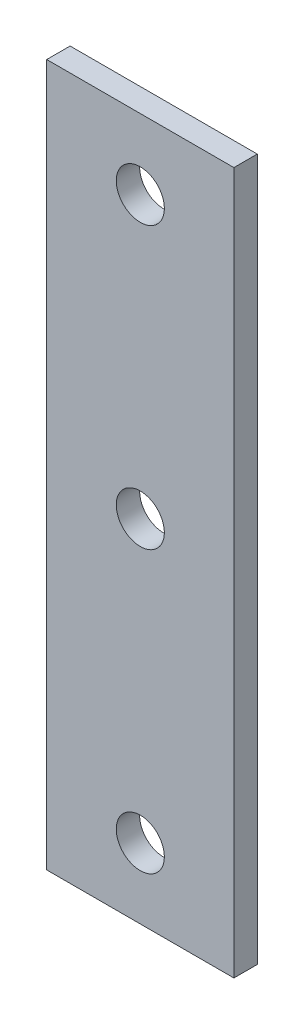
ISO-10303-21;
HEADER;
FILE_DESCRIPTION(('STEP AP214'),'2;1');
FILE_NAME('part.step','',(''),(''),'','','');
FILE_SCHEMA(('AUTOMOTIVE_DESIGN { 1 0 10303 214 1 1 1 1 }'));
ENDSEC;
DATA;
#1=APPLICATION_CONTEXT('core data for automotive mechanical design processes');
#2=APPLICATION_PROTOCOL_DEFINITION('international standard','automotive_design',2000,#1);
#3=PRODUCT_CONTEXT('',#1,'mechanical');
#4=PRODUCT('Part','Part','',(#3));
#5=PRODUCT_RELATED_PRODUCT_CATEGORY('part','',(#4));
#6=PRODUCT_DEFINITION_FORMATION('','',#4);
#7=PRODUCT_DEFINITION_CONTEXT('part definition',#1,'design');
#8=PRODUCT_DEFINITION('design','',#6,#7);
#9=PRODUCT_DEFINITION_SHAPE('','',#8);
#10=(LENGTH_UNIT() NAMED_UNIT(*) SI_UNIT(.MILLI.,.METRE.));
#11=(NAMED_UNIT(*) PLANE_ANGLE_UNIT() SI_UNIT($,.RADIAN.));
#12=(NAMED_UNIT(*) SI_UNIT($,.STERADIAN.) SOLID_ANGLE_UNIT());
#13=UNCERTAINTY_MEASURE_WITH_UNIT(LENGTH_MEASURE(1.E-05),#10,'distance_accuracy_value','');
#14=(GEOMETRIC_REPRESENTATION_CONTEXT(3) GLOBAL_UNCERTAINTY_ASSIGNED_CONTEXT((#13)) GLOBAL_UNIT_ASSIGNED_CONTEXT((#10,
#11,#12)) REPRESENTATION_CONTEXT('',''));
#15=CARTESIAN_POINT('',(0.,0.,0.));
#16=DIRECTION('',(0.,0.,1.));
#17=DIRECTION('',(1.,0.,0.));
#18=AXIS2_PLACEMENT_3D('',#15,#16,#17);
#19=CARTESIAN_POINT('',(6.35,-23.8125,-1.5875));
#20=DIRECTION('',(1.,0.,0.));
#21=DIRECTION('',(0.,0.,-1.));
#22=AXIS2_PLACEMENT_3D('',#19,#20,#21);
#23=PLANE('',#22);
#24=DIRECTION('',(0.,1.,0.));
#25=VECTOR('',#24,1.);
#26=CARTESIAN_POINT('',(6.35,-23.8125,0.));
#27=LINE('',#26,#25);
#28=CARTESIAN_POINT('',(6.35,-23.8125,0.));
#29=VERTEX_POINT('',#28);
#30=CARTESIAN_POINT('',(6.35,23.8125,0.));
#31=VERTEX_POINT('',#30);
#32=EDGE_CURVE('E101',#29,#31,#27,.T.);
#33=ORIENTED_EDGE('',*,*,#32,.F.);
#34=DIRECTION('',(0.,0.,1.));
#35=VECTOR('',#34,1.);
#36=CARTESIAN_POINT('',(6.35,-23.8125,-1.5875));
#37=LINE('',#36,#35);
#38=CARTESIAN_POINT('',(6.35,-23.8125,-1.5875));
#39=VERTEX_POINT('',#38);
#40=EDGE_CURVE('E11',#39,#29,#37,.T.);
#41=ORIENTED_EDGE('',*,*,#40,.F.);
#42=DIRECTION('',(0.,1.,0.));
#43=VECTOR('',#42,1.);
#44=CARTESIAN_POINT('',(6.35,-23.8125,-1.5875));
#45=LINE('',#44,#43);
#46=CARTESIAN_POINT('',(6.35,23.8125,-1.5875));
#47=VERTEX_POINT('',#46);
#48=EDGE_CURVE('E94',#39,#47,#45,.T.);
#49=ORIENTED_EDGE('',*,*,#48,.T.);
#50=DIRECTION('',(0.,0.,1.));
#51=VECTOR('',#50,1.);
#52=CARTESIAN_POINT('',(6.35,23.8125,-1.5875));
#53=LINE('',#52,#51);
#54=EDGE_CURVE('E39',#47,#31,#53,.T.);
#55=ORIENTED_EDGE('',*,*,#54,.T.);
#56=EDGE_LOOP('',(#33,#41,#49,#55));
#57=FACE_BOUND('',#56,.T.);
#58=ADVANCED_FACE('F36',(#57),#23,.T.);
#59=CARTESIAN_POINT('',(-6.35,-23.8125,-1.5875));
#60=DIRECTION('',(0.,-1.,0.));
#61=DIRECTION('',(0.,0.,-1.));
#62=AXIS2_PLACEMENT_3D('',#59,#60,#61);
#63=PLANE('',#62);
#64=DIRECTION('',(1.,0.,0.));
#65=VECTOR('',#64,1.);
#66=CARTESIAN_POINT('',(-6.35,-23.8125,0.));
#67=LINE('',#66,#65);
#68=CARTESIAN_POINT('',(-6.35,-23.8125,0.));
#69=VERTEX_POINT('',#68);
#70=EDGE_CURVE('E96',#69,#29,#67,.T.);
#71=ORIENTED_EDGE('',*,*,#70,.F.);
#72=DIRECTION('',(0.,0.,1.));
#73=VECTOR('',#72,1.);
#74=CARTESIAN_POINT('',(-6.35,-23.8125,-1.5875));
#75=LINE('',#74,#73);
#76=CARTESIAN_POINT('',(-6.35,-23.8125,-1.5875));
#77=VERTEX_POINT('',#76);
#78=EDGE_CURVE('E45',#77,#69,#75,.T.);
#79=ORIENTED_EDGE('',*,*,#78,.F.);
#80=DIRECTION('',(1.,0.,0.));
#81=VECTOR('',#80,1.);
#82=CARTESIAN_POINT('',(-6.35,-23.8125,-1.5875));
#83=LINE('',#82,#81);
#84=EDGE_CURVE('E91',#77,#39,#83,.T.);
#85=ORIENTED_EDGE('',*,*,#84,.T.);
#86=ORIENTED_EDGE('',*,*,#40,.T.);
#87=EDGE_LOOP('',(#71,#79,#85,#86));
#88=FACE_BOUND('',#87,.T.);
#89=ADVANCED_FACE('F112',(#88),#63,.T.);
#90=CARTESIAN_POINT('',(-6.35,-23.8125,-1.5875));
#91=DIRECTION('',(-1.,0.,0.));
#92=DIRECTION('',(0.,0.,1.));
#93=AXIS2_PLACEMENT_3D('',#90,#91,#92);
#94=PLANE('',#93);
#95=DIRECTION('',(0.,-1.,0.));
#96=VECTOR('',#95,1.);
#97=CARTESIAN_POINT('',(-6.35,-23.8125,0.));
#98=LINE('',#97,#96);
#99=CARTESIAN_POINT('',(-6.35,23.8125,0.));
#100=VERTEX_POINT('',#99);
#101=EDGE_CURVE('E86',#100,#69,#98,.T.);
#102=ORIENTED_EDGE('',*,*,#101,.F.);
#103=DIRECTION('',(0.,0.,1.));
#104=VECTOR('',#103,1.);
#105=CARTESIAN_POINT('',(-6.35,23.8125,-1.5875));
#106=LINE('',#105,#104);
#107=CARTESIAN_POINT('',(-6.35,23.8125,-1.5875));
#108=VERTEX_POINT('',#107);
#109=EDGE_CURVE('E81',#108,#100,#106,.T.);
#110=ORIENTED_EDGE('',*,*,#109,.F.);
#111=DIRECTION('',(0.,-1.,0.));
#112=VECTOR('',#111,1.);
#113=CARTESIAN_POINT('',(-6.35,-23.8125,-1.5875));
#114=LINE('',#113,#112);
#115=EDGE_CURVE('E84',#108,#77,#114,.T.);
#116=ORIENTED_EDGE('',*,*,#115,.T.);
#117=ORIENTED_EDGE('',*,*,#78,.T.);
#118=EDGE_LOOP('',(#102,#110,#116,#117));
#119=FACE_BOUND('',#118,.T.);
#120=ADVANCED_FACE('F83',(#119),#94,.T.);
#121=CARTESIAN_POINT('',(-6.35,23.8125,-1.5875));
#122=DIRECTION('',(0.,1.,0.));
#123=DIRECTION('',(0.,0.,1.));
#124=AXIS2_PLACEMENT_3D('',#121,#122,#123);
#125=PLANE('',#124);
#126=DIRECTION('',(-1.,0.,0.));
#127=VECTOR('',#126,1.);
#128=CARTESIAN_POINT('',(-6.35,23.8125,0.));
#129=LINE('',#128,#127);
#130=EDGE_CURVE('E104',#31,#100,#129,.T.);
#131=ORIENTED_EDGE('',*,*,#130,.F.);
#132=ORIENTED_EDGE('',*,*,#54,.F.);
#133=DIRECTION('',(-1.,0.,0.));
#134=VECTOR('',#133,1.);
#135=CARTESIAN_POINT('',(-6.35,23.8125,-1.5875));
#136=LINE('',#135,#134);
#137=EDGE_CURVE('E90',#47,#108,#136,.T.);
#138=ORIENTED_EDGE('',*,*,#137,.T.);
#139=ORIENTED_EDGE('',*,*,#109,.T.);
#140=EDGE_LOOP('',(#131,#132,#138,#139));
#141=FACE_BOUND('',#140,.T.);
#142=ADVANCED_FACE('F93',(#141),#125,.T.);
#143=CARTESIAN_POINT('',(0.,0.,-1.5875));
#144=DIRECTION('',(0.,0.,-1.));
#145=DIRECTION('',(-1.,0.,0.));
#146=AXIS2_PLACEMENT_3D('',#143,#144,#145);
#147=PLANE('',#146);
#148=CARTESIAN_POINT('',(0.,0.,-1.5875));
#149=DIRECTION('',(0.,0.,1.));
#150=DIRECTION('',(1.,0.,0.));
#151=AXIS2_PLACEMENT_3D('',#148,#149,#150);
#152=CIRCLE('',#151,1.63195);
#153=CARTESIAN_POINT('',(1.63195,0.,-1.5875));
#154=VERTEX_POINT('',#153);
#155=EDGE_CURVE('E149',#154,#154,#152,.T.);
#156=ORIENTED_EDGE('',*,*,#155,.T.);
#157=EDGE_LOOP('',(#156));
#158=FACE_BOUND('',#157,.T.);
#159=CARTESIAN_POINT('',(0.,19.05,-1.5875));
#160=DIRECTION('',(0.,0.,1.));
#161=DIRECTION('',(1.,0.,0.));
#162=AXIS2_PLACEMENT_3D('',#159,#160,#161);
#163=CIRCLE('',#162,1.63195);
#164=CARTESIAN_POINT('',(1.63195,19.05,-1.5875));
#165=VERTEX_POINT('',#164);
#166=EDGE_CURVE('E159',#165,#165,#163,.T.);
#167=ORIENTED_EDGE('',*,*,#166,.T.);
#168=EDGE_LOOP('',(#167));
#169=FACE_BOUND('',#168,.T.);
#170=CARTESIAN_POINT('',(0.,-19.05,-1.5875));
#171=DIRECTION('',(0.,0.,1.));
#172=DIRECTION('',(1.,0.,0.));
#173=AXIS2_PLACEMENT_3D('',#170,#171,#172);
#174=CIRCLE('',#173,1.63195);
#175=CARTESIAN_POINT('',(1.63195,-19.05,-1.5875));
#176=VERTEX_POINT('',#175);
#177=EDGE_CURVE('E105',#176,#176,#174,.T.);
#178=ORIENTED_EDGE('',*,*,#177,.T.);
#179=EDGE_LOOP('',(#178));
#180=FACE_BOUND('',#179,.T.);
#181=ORIENTED_EDGE('',*,*,#48,.F.);
#182=ORIENTED_EDGE('',*,*,#84,.F.);
#183=ORIENTED_EDGE('',*,*,#115,.F.);
#184=ORIENTED_EDGE('',*,*,#137,.F.);
#185=EDGE_LOOP('',(#181,#182,#183,#184));
#186=FACE_BOUND('',#185,.T.);
#187=ADVANCED_FACE('F89',(#158,#169,#180,#186),#147,.T.);
#188=CARTESIAN_POINT('',(0.,0.,0.));
#189=DIRECTION('',(0.,0.,-1.));
#190=DIRECTION('',(-1.,0.,0.));
#191=AXIS2_PLACEMENT_3D('',#188,#189,#190);
#192=PLANE('',#191);
#193=CARTESIAN_POINT('',(0.,0.,0.));
#194=DIRECTION('',(0.,0.,1.));
#195=DIRECTION('',(1.,0.,0.));
#196=AXIS2_PLACEMENT_3D('',#193,#194,#195);
#197=CIRCLE('',#196,1.63194999999999);
#198=CARTESIAN_POINT('',(1.63194999999999,0.,0.));
#199=VERTEX_POINT('',#198);
#200=EDGE_CURVE('E152',#199,#199,#197,.T.);
#201=ORIENTED_EDGE('',*,*,#200,.F.);
#202=EDGE_LOOP('',(#201));
#203=FACE_BOUND('',#202,.T.);
#204=CARTESIAN_POINT('',(0.,19.05,0.));
#205=DIRECTION('',(0.,0.,1.));
#206=DIRECTION('',(1.,0.,0.));
#207=AXIS2_PLACEMENT_3D('',#204,#205,#206);
#208=CIRCLE('',#207,1.63194999999999);
#209=CARTESIAN_POINT('',(1.63194999999999,19.05,0.));
#210=VERTEX_POINT('',#209);
#211=EDGE_CURVE('E154',#210,#210,#208,.T.);
#212=ORIENTED_EDGE('',*,*,#211,.F.);
#213=EDGE_LOOP('',(#212));
#214=FACE_BOUND('',#213,.T.);
#215=CARTESIAN_POINT('',(0.,-19.05,0.));
#216=DIRECTION('',(0.,0.,1.));
#217=DIRECTION('',(1.,0.,0.));
#218=AXIS2_PLACEMENT_3D('',#215,#216,#217);
#219=CIRCLE('',#218,1.63194999999999);
#220=CARTESIAN_POINT('',(1.63194999999999,-19.05,0.));
#221=VERTEX_POINT('',#220);
#222=EDGE_CURVE('E162',#221,#221,#219,.T.);
#223=ORIENTED_EDGE('',*,*,#222,.F.);
#224=EDGE_LOOP('',(#223));
#225=FACE_BOUND('',#224,.T.);
#226=ORIENTED_EDGE('',*,*,#32,.T.);
#227=ORIENTED_EDGE('',*,*,#130,.T.);
#228=ORIENTED_EDGE('',*,*,#101,.T.);
#229=ORIENTED_EDGE('',*,*,#70,.T.);
#230=EDGE_LOOP('',(#226,#227,#228,#229));
#231=FACE_BOUND('',#230,.T.);
#232=ADVANCED_FACE('F111',(#203,#214,#225,#231),#192,.F.);
#233=CARTESIAN_POINT('',(0.,-19.05,0.));
#234=DIRECTION('',(0.,0.,1.));
#235=DIRECTION('',(1.,0.,0.));
#236=AXIS2_PLACEMENT_3D('',#233,#234,#235);
#237=CYLINDRICAL_SURFACE('',#236,1.63194999999999);
#238=ORIENTED_EDGE('',*,*,#177,.F.);
#239=EDGE_LOOP('',(#238));
#240=FACE_BOUND('',#239,.T.);
#241=ORIENTED_EDGE('',*,*,#222,.T.);
#242=EDGE_LOOP('',(#241));
#243=FACE_BOUND('',#242,.T.);
#244=ADVANCED_FACE('F130',(#240,#243),#237,.F.);
#245=CARTESIAN_POINT('',(0.,19.05,0.));
#246=DIRECTION('',(0.,0.,1.));
#247=DIRECTION('',(1.,0.,0.));
#248=AXIS2_PLACEMENT_3D('',#245,#246,#247);
#249=CYLINDRICAL_SURFACE('',#248,1.63194999999999);
#250=ORIENTED_EDGE('',*,*,#166,.F.);
#251=EDGE_LOOP('',(#250));
#252=FACE_BOUND('',#251,.T.);
#253=ORIENTED_EDGE('',*,*,#211,.T.);
#254=EDGE_LOOP('',(#253));
#255=FACE_BOUND('',#254,.T.);
#256=ADVANCED_FACE('F137',(#252,#255),#249,.F.);
#257=CARTESIAN_POINT('',(0.,0.,0.));
#258=DIRECTION('',(0.,0.,1.));
#259=DIRECTION('',(1.,0.,0.));
#260=AXIS2_PLACEMENT_3D('',#257,#258,#259);
#261=CYLINDRICAL_SURFACE('',#260,1.63194999999999);
#262=ORIENTED_EDGE('',*,*,#155,.F.);
#263=EDGE_LOOP('',(#262));
#264=FACE_BOUND('',#263,.T.);
#265=ORIENTED_EDGE('',*,*,#200,.T.);
#266=EDGE_LOOP('',(#265));
#267=FACE_BOUND('',#266,.T.);
#268=ADVANCED_FACE('F141',(#264,#267),#261,.F.);
#269=CLOSED_SHELL('',(#58,#89,#120,#142,#187,#232,#244,#256,#268));
#270=MANIFOLD_SOLID_BREP('B2',#269);
#271=ADVANCED_BREP_SHAPE_REPRESENTATION('',(#18,#270),#14);
#272=SHAPE_DEFINITION_REPRESENTATION(#9,#271);
ENDSEC;
END-ISO-10303-21;
